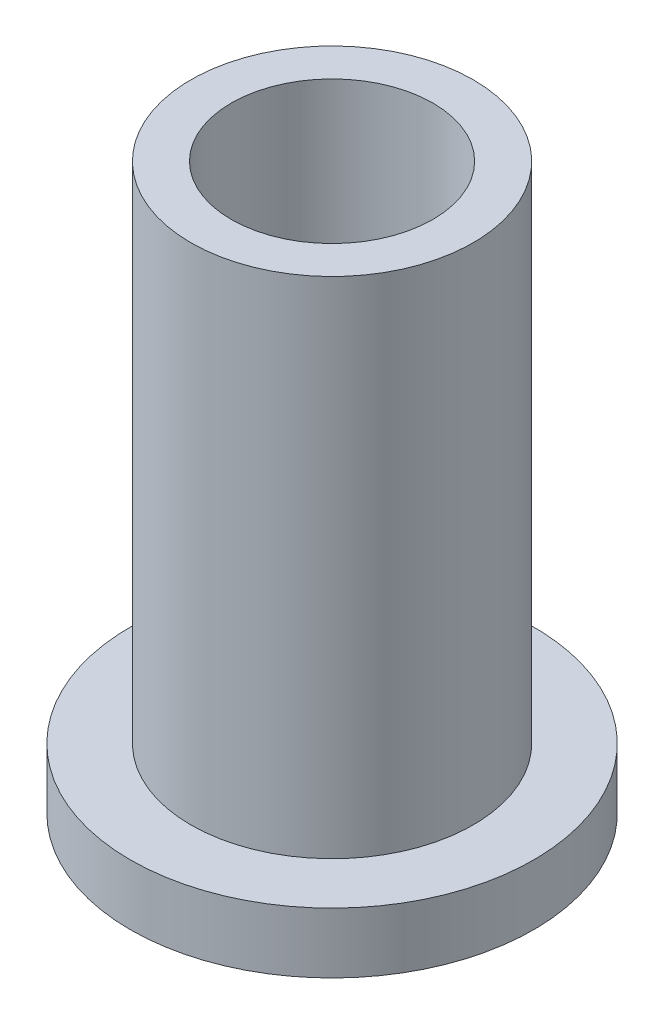
ISO-10303-21;
HEADER;
FILE_DESCRIPTION(('STEP AP214'),'2;1');
FILE_NAME('part.step','',(''),(''),'','','');
FILE_SCHEMA(('AUTOMOTIVE_DESIGN { 1 0 10303 214 1 1 1 1 }'));
ENDSEC;
DATA;
#1=APPLICATION_CONTEXT('core data for automotive mechanical design processes');
#2=APPLICATION_PROTOCOL_DEFINITION('international standard','automotive_design',2000,#1);
#3=PRODUCT_CONTEXT('',#1,'mechanical');
#4=PRODUCT('Part','Part','',(#3));
#5=PRODUCT_RELATED_PRODUCT_CATEGORY('part','',(#4));
#6=PRODUCT_DEFINITION_FORMATION('','',#4);
#7=PRODUCT_DEFINITION_CONTEXT('part definition',#1,'design');
#8=PRODUCT_DEFINITION('design','',#6,#7);
#9=PRODUCT_DEFINITION_SHAPE('','',#8);
#10=(LENGTH_UNIT() NAMED_UNIT(*) SI_UNIT(.MILLI.,.METRE.));
#11=(NAMED_UNIT(*) PLANE_ANGLE_UNIT() SI_UNIT($,.RADIAN.));
#12=(NAMED_UNIT(*) SI_UNIT($,.STERADIAN.) SOLID_ANGLE_UNIT());
#13=UNCERTAINTY_MEASURE_WITH_UNIT(LENGTH_MEASURE(1.E-05),#10,'distance_accuracy_value','');
#14=(GEOMETRIC_REPRESENTATION_CONTEXT(3) GLOBAL_UNCERTAINTY_ASSIGNED_CONTEXT((#13)) GLOBAL_UNIT_ASSIGNED_CONTEXT((#10,
#11,#12)) REPRESENTATION_CONTEXT('',''));
#15=CARTESIAN_POINT('',(0.,0.,0.));
#16=DIRECTION('',(0.,0.,1.));
#17=DIRECTION('',(1.,0.,0.));
#18=AXIS2_PLACEMENT_3D('',#15,#16,#17);
#19=CARTESIAN_POINT('',(0.,1.5,0.));
#20=DIRECTION('',(0.,-1.,0.));
#21=DIRECTION('',(0.,0.,-1.));
#22=AXIS2_PLACEMENT_3D('',#19,#20,#21);
#23=CYLINDRICAL_SURFACE('',#22,5.);
#24=CARTESIAN_POINT('',(0.,1.5,0.));
#25=DIRECTION('',(0.,1.,0.));
#26=DIRECTION('',(0.,0.,1.));
#27=AXIS2_PLACEMENT_3D('',#24,#25,#26);
#28=CIRCLE('',#27,5.);
#29=CARTESIAN_POINT('',(0.,1.5,5.));
#30=VERTEX_POINT('',#29);
#31=EDGE_CURVE('E10',#30,#30,#28,.T.);
#32=ORIENTED_EDGE('',*,*,#31,.F.);
#33=EDGE_LOOP('',(#32));
#34=FACE_BOUND('',#33,.T.);
#35=CARTESIAN_POINT('',(0.,0.,0.));
#36=DIRECTION('',(0.,1.,0.));
#37=DIRECTION('',(0.,0.,1.));
#38=AXIS2_PLACEMENT_3D('',#35,#36,#37);
#39=CIRCLE('',#38,5.);
#40=CARTESIAN_POINT('',(0.,0.,5.));
#41=VERTEX_POINT('',#40);
#42=EDGE_CURVE('E34',#41,#41,#39,.T.);
#43=ORIENTED_EDGE('',*,*,#42,.T.);
#44=EDGE_LOOP('',(#43));
#45=FACE_BOUND('',#44,.T.);
#46=ADVANCED_FACE('F31',(#34,#45),#23,.T.);
#47=CARTESIAN_POINT('',(0.,1.5,0.));
#48=DIRECTION('',(0.,1.,0.));
#49=DIRECTION('',(0.,0.,1.));
#50=AXIS2_PLACEMENT_3D('',#47,#48,#49);
#51=PLANE('',#50);
#52=CARTESIAN_POINT('',(0.,1.5,0.));
#53=DIRECTION('',(0.,1.,0.));
#54=DIRECTION('',(0.,0.,1.));
#55=AXIS2_PLACEMENT_3D('',#52,#53,#54);
#56=CIRCLE('',#55,3.5);
#57=CARTESIAN_POINT('',(0.,1.5,3.5));
#58=VERTEX_POINT('',#57);
#59=EDGE_CURVE('E43',#58,#58,#56,.T.);
#60=ORIENTED_EDGE('',*,*,#59,.F.);
#61=EDGE_LOOP('',(#60));
#62=FACE_BOUND('',#61,.T.);
#63=ORIENTED_EDGE('',*,*,#31,.T.);
#64=EDGE_LOOP('',(#63));
#65=FACE_BOUND('',#64,.T.);
#66=ADVANCED_FACE('F76',(#62,#65),#51,.T.);
#67=CARTESIAN_POINT('',(0.,0.,0.));
#68=DIRECTION('',(0.,1.,0.));
#69=DIRECTION('',(0.,0.,1.));
#70=AXIS2_PLACEMENT_3D('',#67,#68,#69);
#71=PLANE('',#70);
#72=CARTESIAN_POINT('',(0.,0.,0.));
#73=DIRECTION('',(0.,1.,0.));
#74=DIRECTION('',(0.,0.,1.));
#75=AXIS2_PLACEMENT_3D('',#72,#73,#74);
#76=CIRCLE('',#75,2.5);
#77=CARTESIAN_POINT('',(0.,0.,2.5));
#78=VERTEX_POINT('',#77);
#79=EDGE_CURVE('E46',#78,#78,#76,.T.);
#80=ORIENTED_EDGE('',*,*,#79,.T.);
#81=EDGE_LOOP('',(#80));
#82=FACE_BOUND('',#81,.T.);
#83=ORIENTED_EDGE('',*,*,#42,.F.);
#84=EDGE_LOOP('',(#83));
#85=FACE_BOUND('',#84,.T.);
#86=ADVANCED_FACE('F55',(#82,#85),#71,.F.);
#87=CARTESIAN_POINT('',(0.,14.,0.));
#88=DIRECTION('',(0.,-1.,0.));
#89=DIRECTION('',(0.,0.,-1.));
#90=AXIS2_PLACEMENT_3D('',#87,#88,#89);
#91=CYLINDRICAL_SURFACE('',#90,3.5);
#92=CARTESIAN_POINT('',(0.,14.,0.));
#93=DIRECTION('',(0.,1.,0.));
#94=DIRECTION('',(0.,0.,1.));
#95=AXIS2_PLACEMENT_3D('',#92,#93,#94);
#96=CIRCLE('',#95,3.5);
#97=CARTESIAN_POINT('',(0.,14.,3.5));
#98=VERTEX_POINT('',#97);
#99=EDGE_CURVE('E41',#98,#98,#96,.T.);
#100=ORIENTED_EDGE('',*,*,#99,.F.);
#101=EDGE_LOOP('',(#100));
#102=FACE_BOUND('',#101,.T.);
#103=ORIENTED_EDGE('',*,*,#59,.T.);
#104=EDGE_LOOP('',(#103));
#105=FACE_BOUND('',#104,.T.);
#106=ADVANCED_FACE('F67',(#102,#105),#91,.T.);
#107=CARTESIAN_POINT('',(0.,14.,0.));
#108=DIRECTION('',(0.,1.,0.));
#109=DIRECTION('',(0.,0.,1.));
#110=AXIS2_PLACEMENT_3D('',#107,#108,#109);
#111=PLANE('',#110);
#112=CARTESIAN_POINT('',(0.,14.,0.));
#113=DIRECTION('',(0.,1.,0.));
#114=DIRECTION('',(0.,0.,1.));
#115=AXIS2_PLACEMENT_3D('',#112,#113,#114);
#116=CIRCLE('',#115,2.5);
#117=CARTESIAN_POINT('',(0.,14.,2.5));
#118=VERTEX_POINT('',#117);
#119=EDGE_CURVE('E49',#118,#118,#116,.T.);
#120=ORIENTED_EDGE('',*,*,#119,.F.);
#121=EDGE_LOOP('',(#120));
#122=FACE_BOUND('',#121,.T.);
#123=ORIENTED_EDGE('',*,*,#99,.T.);
#124=EDGE_LOOP('',(#123));
#125=FACE_BOUND('',#124,.T.);
#126=ADVANCED_FACE('F61',(#122,#125),#111,.T.);
#127=CARTESIAN_POINT('',(0.,0.,0.));
#128=DIRECTION('',(0.,1.,0.));
#129=DIRECTION('',(0.,0.,1.));
#130=AXIS2_PLACEMENT_3D('',#127,#128,#129);
#131=CYLINDRICAL_SURFACE('',#130,2.5);
#132=ORIENTED_EDGE('',*,*,#79,.F.);
#133=EDGE_LOOP('',(#132));
#134=FACE_BOUND('',#133,.T.);
#135=ORIENTED_EDGE('',*,*,#119,.T.);
#136=EDGE_LOOP('',(#135));
#137=FACE_BOUND('',#136,.T.);
#138=ADVANCED_FACE('F58',(#134,#137),#131,.F.);
#139=CLOSED_SHELL('',(#46,#66,#86,#106,#126,#138));
#140=MANIFOLD_SOLID_BREP('B2',#139);
#141=ADVANCED_BREP_SHAPE_REPRESENTATION('',(#18,#140),#14);
#142=SHAPE_DEFINITION_REPRESENTATION(#9,#141);
ENDSEC;
END-ISO-10303-21;
